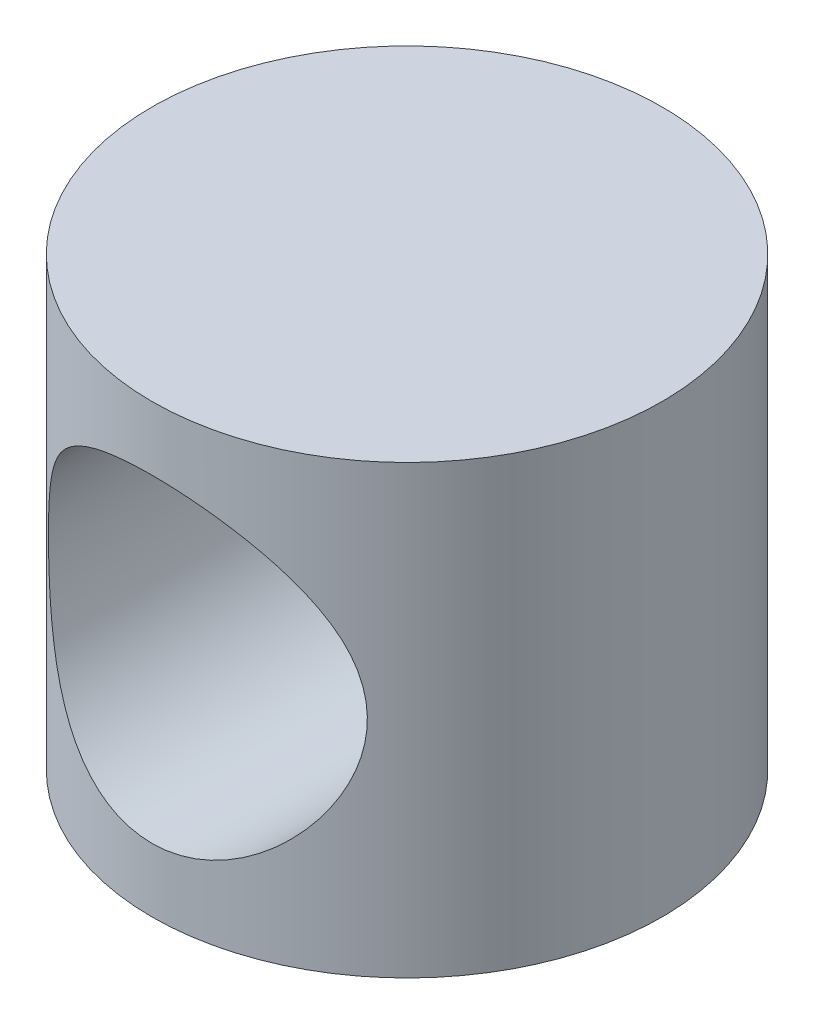
ISO-10303-21;
HEADER;
FILE_DESCRIPTION(('STEP AP214'),'2;1');
FILE_NAME('part.step','',(''),(''),'','','');
FILE_SCHEMA(('AUTOMOTIVE_DESIGN { 1 0 10303 214 1 1 1 1 }'));
ENDSEC;
DATA;
#1=APPLICATION_CONTEXT('core data for automotive mechanical design processes');
#2=APPLICATION_PROTOCOL_DEFINITION('international standard','automotive_design',2000,#1);
#3=PRODUCT_CONTEXT('',#1,'mechanical');
#4=PRODUCT('Part','Part','',(#3));
#5=PRODUCT_RELATED_PRODUCT_CATEGORY('part','',(#4));
#6=PRODUCT_DEFINITION_FORMATION('','',#4);
#7=PRODUCT_DEFINITION_CONTEXT('part definition',#1,'design');
#8=PRODUCT_DEFINITION('design','',#6,#7);
#9=PRODUCT_DEFINITION_SHAPE('','',#8);
#10=(LENGTH_UNIT() NAMED_UNIT(*) SI_UNIT(.MILLI.,.METRE.));
#11=(NAMED_UNIT(*) PLANE_ANGLE_UNIT() SI_UNIT($,.RADIAN.));
#12=(NAMED_UNIT(*) SI_UNIT($,.STERADIAN.) SOLID_ANGLE_UNIT());
#13=UNCERTAINTY_MEASURE_WITH_UNIT(LENGTH_MEASURE(1.E-05),#10,'distance_accuracy_value','');
#14=(GEOMETRIC_REPRESENTATION_CONTEXT(3) GLOBAL_UNCERTAINTY_ASSIGNED_CONTEXT((#13)) GLOBAL_UNIT_ASSIGNED_CONTEXT((#10,
#11,#12)) REPRESENTATION_CONTEXT('',''));
#15=CARTESIAN_POINT('',(0.,0.,0.));
#16=DIRECTION('',(0.,0.,1.));
#17=DIRECTION('',(1.,0.,0.));
#18=AXIS2_PLACEMENT_3D('',#15,#16,#17);
#19=CARTESIAN_POINT('',(0.,7.,0.));
#20=DIRECTION('',(0.,-1.,0.));
#21=DIRECTION('',(0.,0.,-1.));
#22=AXIS2_PLACEMENT_3D('',#19,#20,#21);
#23=CYLINDRICAL_SURFACE('',#22,4.);
#24=CARTESIAN_POINT('',(0.,7.,0.));
#25=DIRECTION('',(0.,1.,0.));
#26=DIRECTION('',(0.,0.,1.));
#27=AXIS2_PLACEMENT_3D('',#24,#25,#26);
#28=CIRCLE('',#27,4.);
#29=CARTESIAN_POINT('',(0.,7.,4.));
#30=VERTEX_POINT('',#29);
#31=EDGE_CURVE('E10',#30,#30,#28,.T.);
#32=ORIENTED_EDGE('',*,*,#31,.F.);
#33=EDGE_LOOP('',(#32));
#34=FACE_BOUND('',#33,.T.);
#35=CARTESIAN_POINT('',(0.,0.,0.));
#36=DIRECTION('',(0.,1.,0.));
#37=DIRECTION('',(0.,0.,1.));
#38=AXIS2_PLACEMENT_3D('',#35,#36,#37);
#39=CIRCLE('',#38,4.);
#40=CARTESIAN_POINT('',(0.,0.,4.));
#41=VERTEX_POINT('',#40);
#42=EDGE_CURVE('E56',#41,#41,#39,.T.);
#43=ORIENTED_EDGE('',*,*,#42,.T.);
#44=EDGE_LOOP('',(#43));
#45=FACE_BOUND('',#44,.T.);
#46=CARTESIAN_POINT('',(-2.5,3.5,3.1224989991992));
#47=CARTESIAN_POINT('',(-2.49999941097139,3.43784324855449,3.12249991555421));
#48=CARTESIAN_POINT('',(-2.49767581942173,3.37567405332921,3.12436490733917));
#49=CARTESIAN_POINT('',(-2.48843349840857,3.25188282045226,3.13172923119026));
#50=CARTESIAN_POINT('',(-2.48151206248433,3.1902611267429,3.13723070381364));
#51=CARTESIAN_POINT('',(-2.45397595058365,3.00677395225629,3.15888953558505));
#52=CARTESIAN_POINT('',(-2.42658990946459,2.88645166881102,3.18020036271142));
#53=CARTESIAN_POINT('',(-2.35576217141198,2.65440180212176,3.23299770760367));
#54=CARTESIAN_POINT('',(-2.31245961359202,2.5426095849449,3.26439575383209));
#55=CARTESIAN_POINT('',(-2.21143916430899,2.32799147466594,3.3336600088444));
#56=CARTESIAN_POINT('',(-2.15372087963017,2.22516582624691,3.37152639405534));
#57=CARTESIAN_POINT('',(-2.01647682425577,2.01626601869634,3.45559225121876));
#58=CARTESIAN_POINT('',(-1.93506425666949,1.91160667499548,3.50222814511578));
#59=CARTESIAN_POINT('',(-1.75662526657432,1.7162384483762,3.59505503533368));
#60=CARTESIAN_POINT('',(-1.65958538899782,1.62554172004638,3.64124561158438));
#61=CARTESIAN_POINT('',(-1.43833990582854,1.44977970182732,3.73459524771314));
#62=CARTESIAN_POINT('',(-1.31226934259652,1.36671381554957,3.78119887781505));
#63=CARTESIAN_POINT('',(-1.11163395543429,1.25945484526376,3.84307251838774));
#64=CARTESIAN_POINT('',(-1.04281240974104,1.22658486166689,3.86236283092052));
#65=CARTESIAN_POINT('',(-0.901758767615549,1.16704531463672,3.89770436975436));
#66=CARTESIAN_POINT('',(-0.829529068393796,1.14037146896158,3.91375783207118));
#67=CARTESIAN_POINT('',(-0.689700297916576,1.09601618474372,3.94066759113823));
#68=CARTESIAN_POINT('',(-0.622371981278588,1.07769802348189,3.95188535984466));
#69=CARTESIAN_POINT('',(-0.485997575898808,1.04669771368664,3.97096241909162));
#70=CARTESIAN_POINT('',(-0.416952503441682,1.03401231078379,3.97882364879721));
#71=CARTESIAN_POINT('',(-0.277765449857174,1.01448620236546,3.99095470334737));
#72=CARTESIAN_POINT('',(-0.207624174243906,1.00764188348659,3.99522674847834));
#73=CARTESIAN_POINT('',(-0.066911446659939,0.999900786610777,4.00006125072438));
#74=CARTESIAN_POINT('',(0.00365995486027895,0.99900332403665,4.00062413482248));
#75=CARTESIAN_POINT('',(0.196045081555538,1.00472537354725,3.99704479619503));
#76=CARTESIAN_POINT('',(0.317681845488536,1.01730650307888,3.98917040897436));
#77=CARTESIAN_POINT('',(0.556636494620256,1.05973021796612,3.96290903275931));
#78=CARTESIAN_POINT('',(0.673954052677426,1.08957410797362,3.94452124920477));
#79=CARTESIAN_POINT('',(0.901771991763867,1.16520855928326,3.89876170711609));
#80=CARTESIAN_POINT('',(1.01225407159606,1.21103991957107,3.87136697381047));
#81=CARTESIAN_POINT('',(1.22404012071223,1.31693723898429,3.80971291751354));
#82=CARTESIAN_POINT('',(1.32534199174245,1.37700644106365,3.77545203089318));
#83=CARTESIAN_POINT('',(1.52942649744659,1.51805641692367,3.69786441247167));
#84=CARTESIAN_POINT('',(1.63082454612907,1.60070927669048,3.65394006381521));
#85=CARTESIAN_POINT('',(1.81919733573063,1.78026473720707,3.56390927740507));
#86=CARTESIAN_POINT('',(1.90615071842624,1.87718804638397,3.51779973570409));
#87=CARTESIAN_POINT('',(2.07470887167909,2.09741125317348,3.42142883464466));
#88=CARTESIAN_POINT('',(2.15413229677844,2.22250276335808,3.37141162686597));
#89=CARTESIAN_POINT('',(2.29052307550563,2.48729223730141,3.28028278192382));
#90=CARTESIAN_POINT('',(2.34753179448504,2.62696268745311,3.23915480386931));
#91=CARTESIAN_POINT('',(2.42437133527931,2.87953880610625,3.18183753131763));
#92=CARTESIAN_POINT('',(2.45003683445404,2.98982192521349,3.16193408602513));
#93=CARTESIAN_POINT('',(2.48620337073091,3.21423037755989,3.13358277759547));
#94=CARTESIAN_POINT('',(2.49672512520811,3.32835024265681,3.12511926504439));
#95=CARTESIAN_POINT('',(2.5019707209518,3.55745736050245,3.12092267030677));
#96=CARTESIAN_POINT('',(2.49665835896695,3.67244600047845,3.12521876170185));
#97=CARTESIAN_POINT('',(2.47051466367814,3.89956116431848,3.14592085836188));
#98=CARTESIAN_POINT('',(2.44967047849126,4.01168523837118,3.16233689222906));
#99=CARTESIAN_POINT('',(2.39409874195038,4.22843675942569,3.20460120797143));
#100=CARTESIAN_POINT('',(2.35960571424758,4.33315731589432,3.23028954367817));
#101=CARTESIAN_POINT('',(2.27804893702243,4.53557469989379,3.28831148388749));
#102=CARTESIAN_POINT('',(2.23098072583746,4.63326901887797,3.32064744602081));
#103=CARTESIAN_POINT('',(2.11530798730694,4.83861194166319,3.39574401285203));
#104=CARTESIAN_POINT('',(2.04430931160544,4.94461452730177,3.43931724293015));
#105=CARTESIAN_POINT('',(1.88737868921489,5.14437066065426,3.52787943213338));
#106=CARTESIAN_POINT('',(1.80143124902619,5.23811132124234,3.57286982004467));
#107=CARTESIAN_POINT('',(1.6007693249212,5.42596407064096,3.66766209459505));
#108=CARTESIAN_POINT('',(1.48365201617177,5.5177273984849,3.71707933883201));
#109=CARTESIAN_POINT('',(1.23256787407809,5.68014701471972,3.80768973398606));
#110=CARTESIAN_POINT('',(1.09860897940974,5.75081319512692,3.84888673619009));
#111=CARTESIAN_POINT('',(0.89193080465508,5.83658106797498,3.89988966499776));
#112=CARTESIAN_POINT('',(0.824318196039419,5.86129744395128,3.91477055097245));
#113=CARTESIAN_POINT('',(0.686640792876421,5.90493827673227,3.94124643918619));
#114=CARTESIAN_POINT('',(0.616577444051133,5.92386608615092,3.95284334314805));
#115=CARTESIAN_POINT('',(0.474639231464261,5.95560583013926,3.9723851203995));
#116=CARTESIAN_POINT('',(0.402766005755504,5.96842309951643,3.98033317908836));
#117=CARTESIAN_POINT('',(0.257881807142458,5.98773917229289,3.99234168343343));
#118=CARTESIAN_POINT('',(0.184871024482532,5.99423902093079,3.99640277220024));
#119=CARTESIAN_POINT('',(-0.013110277424895,6.00307151550711,4.00191521492706));
#120=CARTESIAN_POINT('',(-0.138539079205452,5.99926579290941,3.99952706123947));
#121=CARTESIAN_POINT('',(-0.386583137102134,5.97308241045447,3.98321975018363));
#122=CARTESIAN_POINT('',(-0.509198520626833,5.95070559332119,3.96930111604857));
#123=CARTESIAN_POINT('',(-0.744080605483852,5.88967758445389,3.93192083384285));
#124=CARTESIAN_POINT('',(-0.856558752631814,5.85161792643533,3.90880701054803));
#125=CARTESIAN_POINT('',(-1.07343034721918,5.76088053755652,3.85489971248843));
#126=CARTESIAN_POINT('',(-1.17782242685803,5.7082003404328,3.82410494215309));
#127=CARTESIAN_POINT('',(-1.38731297754797,5.58367872128004,3.75350673935648));
#128=CARTESIAN_POINT('',(-1.4913601218378,5.5104160092425,3.71310001864657));
#129=CARTESIAN_POINT('',(-1.68643334934803,5.3498467674859,3.62867283985206));
#130=CARTESIAN_POINT('',(-1.77744451843681,5.26252439116572,3.58464833191203));
#131=CARTESIAN_POINT('',(-1.95744716561589,5.06176748493813,3.49000828219718));
#132=CARTESIAN_POINT('',(-2.04425661250063,4.94638338742857,3.43935738427104));
#133=CARTESIAN_POINT('',(-2.19754648509904,4.70071059024024,3.34349647457112));
#134=CARTESIAN_POINT('',(-2.26403815415028,4.57043018884747,3.2982834620419));
#135=CARTESIAN_POINT('',(-2.3619822941284,4.32719469921509,3.22859539780091));
#136=CARTESIAN_POINT('',(-2.39792458576829,4.21672942784644,3.20174639338769));
#137=CARTESIAN_POINT('',(-2.45425618419746,3.99006065699822,3.1587835810451));
#138=CARTESIAN_POINT('',(-2.47469472410168,3.87387658020028,3.14263581150428));
#139=CARTESIAN_POINT('',(-2.49119847139522,3.71394000535393,3.12952857640607));
#140=CARTESIAN_POINT('',(-2.49449433837959,3.67127447429134,3.1268999430677));
#141=CARTESIAN_POINT('',(-2.49889558125807,3.58574130104825,3.12338461939862));
#142=CARTESIAN_POINT('',(-2.50000040629188,3.54287361075665,3.12249836712871));
#143=CARTESIAN_POINT('',(-2.5,3.5,3.1224989991992));
#144=B_SPLINE_CURVE_WITH_KNOTS('',3,(#46,#47,#48,#49,#50,#51,#52,#53,#54,#55,#56,#57,#58,#59,
#60,#61,#62,#63,#64,#65,#66,#67,#68,#69,#70,#71,#72,#73,#74,#75,#76,#77,#78,#79,#80,#81,#82,#83,
#84,#85,#86,#87,#88,#89,#90,#91,#92,#93,#94,#95,#96,#97,#98,#99,#100,#101,#102,#103,#104,#105,
#106,#107,#108,#109,#110,#111,#112,#113,#114,#115,#116,#117,#118,#119,#120,#121,#122,#123,#124,
#125,#126,#127,#128,#129,#130,#131,#132,#133,#134,#135,#136,#137,#138,#139,#140,#141,#142,#143),
.UNSPECIFIED.,.T.,.F.,(4,2,2,2,2,2,2,2,2,2,2,2,2,2,2,2,2,2,2,2,2,2,2,2,2,2,2,2,2,2,2,2,2,2,2,2,
2,2,2,2,2,2,2,2,2,2,2,2,4),(0.,0.18641531585846,0.372940459994496,0.746478880764687,
1.11682668423133,1.48718459072605,1.90722798685071,2.32763499192879,2.7987602926597,
3.03445880867314,3.26999394209509,3.48170145743205,3.69328649746504,3.90474055342595,
4.11617026725867,4.48184709708114,4.84755156693919,5.21419620193004,5.58092442797435,
5.99329080205307,6.40626158573465,6.87316206383505,7.33919680735486,7.68265621505466,
8.02564530559509,8.36941921026407,8.7134778886509,9.05186495232125,9.390372235192,
9.79332737765187,10.1967026751544,10.6647326786671,11.1325428866818,11.3527929661039,
11.5729152387446,11.7928449800804,12.0127383271002,12.3871595324234,12.7615637480926,
13.1229788842094,13.4844550226785,13.8834503840958,14.2828986410983,14.7399238503459,
15.1966956936287,15.5530255473292,15.9082190611886,16.0367696833384,16.1653526209168),.UNSPECIFIED.);
#145=CARTESIAN_POINT('',(-2.5,3.5,3.1224989991992));
#146=VERTEX_POINT('',#145);
#147=EDGE_CURVE('E63',#146,#146,#144,.T.);
#148=ORIENTED_EDGE('',*,*,#147,.F.);
#149=EDGE_LOOP('',(#148));
#150=FACE_BOUND('',#149,.T.);
#151=CARTESIAN_POINT('',(0.,6.,-4.));
#152=CARTESIAN_POINT('',(0.127017476559871,5.99998952385639,-3.99999041333571));
#153=CARTESIAN_POINT('',(0.254191951791703,5.99025350009832,-3.9938860659399));
#154=CARTESIAN_POINT('',(0.504637456621344,5.95182887031573,-3.97004375552586));
#155=CARTESIAN_POINT('',(0.627900575825985,5.92310413973879,-3.95228361873137));
#156=CARTESIAN_POINT('',(0.866410868269162,5.84837714671246,-3.90691695293563));
#157=CARTESIAN_POINT('',(0.98169442070943,5.80246039021243,-3.87935918690877));
#158=CARTESIAN_POINT('',(1.20252080434994,5.69522833250853,-3.81669199838277));
#159=CARTESIAN_POINT('',(1.30806471304098,5.63391473744688,-3.7815834126609));
#160=CARTESIAN_POINT('',(1.51594836437078,5.4922268434089,-3.70340304945467));
#161=CARTESIAN_POINT('',(1.61735911616791,5.41072139729824,-3.65991924217889));
#162=CARTESIAN_POINT('',(1.80597275567284,5.23356165374148,-3.57062700058922));
#163=CARTESIAN_POINT('',(1.89315621594405,5.13788834426107,-3.52481549782957));
#164=CARTESIAN_POINT('',(2.06285746302521,4.9199322107088,-3.42860837235627));
#165=CARTESIAN_POINT('',(2.14314412018317,4.79580042656906,-3.37843221966147));
#166=CARTESIAN_POINT('',(2.28147932079995,4.53287036932165,-3.28660396278105));
#167=CARTESIAN_POINT('',(2.33956541787438,4.39409737483202,-3.2449375200046));
#168=CARTESIAN_POINT('',(2.41866801180576,4.14237895245428,-3.18619151248815));
#169=CARTESIAN_POINT('',(2.44539104794679,4.03206636308168,-3.16553811970886));
#170=CARTESIAN_POINT('',(2.4836368711914,3.80738814861931,-3.1356271466086));
#171=CARTESIAN_POINT('',(2.49518112485638,3.69302848282679,-3.12635347378456));
#172=CARTESIAN_POINT('',(2.50237836690497,3.46317396712363,-3.12059771534501));
#173=CARTESIAN_POINT('',(2.49798968200884,3.34767692942204,-3.12414917427958));
#174=CARTESIAN_POINT('',(2.47352633347829,3.11937979127337,-3.14354804883411));
#175=CARTESIAN_POINT('',(2.45343909745149,3.00658192715007,-3.15940531965489));
#176=CARTESIAN_POINT('',(2.3993620946426,2.78912310325641,-3.20065145822146));
#177=CARTESIAN_POINT('',(2.36570043522604,2.68433512028263,-3.22581428653572));
#178=CARTESIAN_POINT('',(2.28580369589507,2.48167760352679,-3.28291134443418));
#179=CARTESIAN_POINT('',(2.2395641689404,2.38381053215654,-3.31484796808523));
#180=CARTESIAN_POINT('',(2.12589830407261,2.17833359248984,-3.38909625095658));
#181=CARTESIAN_POINT('',(2.05612773657747,2.07231894814762,-3.4322315520855));
#182=CARTESIAN_POINT('',(1.90176111958637,1.8723388730236,-3.52011451554715));
#183=CARTESIAN_POINT('',(1.81714983251341,1.77838599995486,-3.56486379714022));
#184=CARTESIAN_POINT('',(1.61904732877734,1.58939899041739,-3.65959667460597));
#185=CARTESIAN_POINT('',(1.50309447420016,1.4967440572784,-3.70922571443728));
#186=CARTESIAN_POINT('',(1.25426444468514,1.33228820636898,-3.8005660184067));
#187=CARTESIAN_POINT('',(1.12139395127005,1.26047909219051,-3.84228039228673));
#188=CARTESIAN_POINT('',(0.915775751567441,1.17265404336502,-3.89435975869902));
#189=CARTESIAN_POINT('',(0.848193583187391,1.14716571356961,-3.90966874385268));
#190=CARTESIAN_POINT('',(0.710492049478444,1.10199234952136,-3.93701839875445));
#191=CARTESIAN_POINT('',(0.640374175967898,1.08230396342918,-3.94906095588034));
#192=CARTESIAN_POINT('',(0.498239019538471,1.04906583835761,-3.96949699527849));
#193=CARTESIAN_POINT('',(0.426223500915274,1.035510596474,-3.97789374843884));
#194=CARTESIAN_POINT('',(0.280965673560731,1.01475370668643,-3.99078766491331));
#195=CARTESIAN_POINT('',(0.207723576570751,1.00755097345269,-3.99528549435853));
#196=CARTESIAN_POINT('',(0.00911917689680526,0.996890695356459,-4.00193773474167));
#197=CARTESIAN_POINT('',(-0.116782016705695,0.999599636876483,-4.000238122366));
#198=CARTESIAN_POINT('',(-0.365967766011667,1.02375966446545,-3.98518313408306));
#199=CARTESIAN_POINT('',(-0.48925249935995,1.04520947392473,-3.97182855210102));
#200=CARTESIAN_POINT('',(-0.7250361940026,1.10447858798278,-3.93547975555369));
#201=CARTESIAN_POINT('',(-0.837768421062911,1.14162472076979,-3.91288306371126));
#202=CARTESIAN_POINT('',(-1.05527816125332,1.23059237131243,-3.85991402897874));
#203=CARTESIAN_POINT('',(-1.16005433861599,1.28241634650143,-3.82954038411642));
#204=CARTESIAN_POINT('',(-1.37016761969194,1.40503053750783,-3.75980014020658));
#205=CARTESIAN_POINT('',(-1.47449380296905,1.47720717227503,-3.71983526755373));
#206=CARTESIAN_POINT('',(-1.67028541330073,1.63558769646929,-3.63613942885727));
#207=CARTESIAN_POINT('',(-1.76173634038025,1.72180716888569,-3.59240430473134));
#208=CARTESIAN_POINT('',(-1.94294835276253,1.92027008984565,-3.49811738486729));
#209=CARTESIAN_POINT('',(-2.03053702733638,2.03447441549752,-3.44749766579192));
#210=CARTESIAN_POINT('',(-2.18560704916439,2.27775156698257,-3.35133525746893));
#211=CARTESIAN_POINT('',(-2.25310231693768,2.40681401289131,-3.30578906708369));
#212=CARTESIAN_POINT('',(-2.35369543821018,2.64938429659957,-3.23467060578839));
#213=CARTESIAN_POINT('',(-2.39103791720685,2.76048150138871,-3.20691272363805));
#214=CARTESIAN_POINT('',(-2.45000216420748,2.98878629161345,-3.16210061351252));
#215=CARTESIAN_POINT('',(-2.47164849805251,3.10598401968943,-3.1450296652982));
#216=CARTESIAN_POINT('',(-2.49802767469226,3.3441805529704,-3.124126499326));
#217=CARTESIAN_POINT('',(-2.50266374586469,3.46519716787993,-3.12037003193165));
#218=CARTESIAN_POINT('',(-2.49439556773531,3.70626192382952,-3.12698126375719));
#219=CARTESIAN_POINT('',(-2.48148548821457,3.82630972961936,-3.13735365770479));
#220=CARTESIAN_POINT('',(-2.44076547086104,4.05205957943611,-3.16910777009989));
#221=CARTESIAN_POINT('',(-2.41423847191721,4.15813856450238,-3.18953614189074));
#222=CARTESIAN_POINT('',(-2.34835238743426,4.36427015751826,-3.23835062785226));
#223=CARTESIAN_POINT('',(-2.30898795090781,4.46432023181727,-3.26674005971309));
#224=CARTESIAN_POINT('',(-2.21205415803959,4.67119332433814,-3.33327797617852));
#225=CARTESIAN_POINT('',(-2.15267427981667,4.77689994626374,-3.3722442852408));
#226=CARTESIAN_POINT('',(-2.01999894889208,4.97787738570926,-3.45335445323995));
#227=CARTESIAN_POINT('',(-1.94669224594686,5.07313966737408,-3.49550086438999));
#228=CARTESIAN_POINT('',(-1.77134669685941,5.27002558379843,-3.58803675426846));
#229=CARTESIAN_POINT('',(-1.66649284489893,5.36916976153929,-3.63840488260278));
#230=CARTESIAN_POINT('',(-1.43961937990848,5.54900159612506,-3.7339805383823));
#231=CARTESIAN_POINT('',(-1.3175892119665,5.62967782367752,-3.77918486147258));
#232=CARTESIAN_POINT('',(-1.12346357942551,5.73456343855876,-3.83959214728415));
#233=CARTESIAN_POINT('',(-1.05679601158094,5.76687480004699,-3.85851834157058));
#234=CARTESIAN_POINT('',(-0.920199584374062,5.82567225182379,-3.89335165397882));
#235=CARTESIAN_POINT('',(-0.850272633931984,5.8521617011351,-3.9092605122592));
#236=CARTESIAN_POINT('',(-0.707873688437766,5.89885714446217,-3.93753374175517));
#237=CARTESIAN_POINT('',(-0.635409144572264,5.91908005724566,-3.94990764965183));
#238=CARTESIAN_POINT('',(-0.488456989557114,5.95297545558237,-3.97075677458059));
#239=CARTESIAN_POINT('',(-0.413970913545527,5.96665277243948,-3.97923486692924));
#240=CARTESIAN_POINT('',(-0.282852605094049,5.98459041022673,-3.99038271291772));
#241=CARTESIAN_POINT('',(-0.226501515914867,5.99036153025218,-3.99398159517595));
#242=CARTESIAN_POINT('',(-0.113444074519046,5.99806878362715,-3.99879245372932));
#243=CARTESIAN_POINT('',(-0.056737700531305,6.00000467961036,-4.00000428228699));
#244=CARTESIAN_POINT('',(0.,6.,-4.));
#245=B_SPLINE_CURVE_WITH_KNOTS('',3,(#151,#152,#153,#154,#155,#156,#157,#158,#159,#160,#161,
#162,#163,#164,#165,#166,#167,#168,#169,#170,#171,#172,#173,#174,#175,#176,#177,#178,#179,#180,
#181,#182,#183,#184,#185,#186,#187,#188,#189,#190,#191,#192,#193,#194,#195,#196,#197,#198,#199,
#200,#201,#202,#203,#204,#205,#206,#207,#208,#209,#210,#211,#212,#213,#214,#215,#216,#217,#218,
#219,#220,#221,#222,#223,#224,#225,#226,#227,#228,#229,#230,#231,#232,#233,#234,#235,#236,#237,
#238,#239,#240,#241,#242,#243,#244),.UNSPECIFIED.,.T.,.F.,(4,2,2,2,2,2,2,2,2,2,2,2,2,2,2,2,2,2,
2,2,2,2,2,2,2,2,2,2,2,2,2,2,2,2,2,2,2,2,2,2,2,2,2,2,2,2,4),(0.,0.380824602868265,
0.762375788256924,1.14205397519027,1.52169010807759,1.93164374107244,2.34215256651403,
2.80825951705947,3.27357449214021,3.61824017759434,3.96241789414782,4.30749646997556,
4.65285169010166,4.99031678920873,5.32790135816066,5.72854900708719,6.12961045150364,
6.59684361399044,7.06389281455723,7.28510978359956,7.50619865744383,7.72708876613708,
7.94794112831293,8.32363778110178,8.69930884379593,9.06028425977629,9.42132014771965,
9.81879878896137,10.216721545704,10.6724083464246,11.1277787130885,11.4876929754247,
11.8470427174174,12.2084336629143,12.5699447204276,12.9023575499051,13.2349091154192,
13.6156046298899,13.9966089922257,14.4531049498526,14.9098826607203,15.1389848639481,
15.3679545348469,15.5963005225023,15.8244777070605,15.994578512822,16.1646898459841),.UNSPECIFIED.);
#246=CARTESIAN_POINT('',(0.,6.,-4.));
#247=VERTEX_POINT('',#246);
#248=EDGE_CURVE('E47',#247,#247,#245,.T.);
#249=ORIENTED_EDGE('',*,*,#248,.F.);
#250=EDGE_LOOP('',(#249));
#251=FACE_BOUND('',#250,.T.);
#252=ADVANCED_FACE('F43',(#34,#45,#150,#251),#23,.T.);
#253=CARTESIAN_POINT('',(0.,7.,0.));
#254=DIRECTION('',(0.,1.,0.));
#255=DIRECTION('',(0.,0.,1.));
#256=AXIS2_PLACEMENT_3D('',#253,#254,#255);
#257=PLANE('',#256);
#258=ORIENTED_EDGE('',*,*,#31,.T.);
#259=EDGE_LOOP('',(#258));
#260=FACE_BOUND('',#259,.T.);
#261=ADVANCED_FACE('F75',(#260),#257,.T.);
#262=CARTESIAN_POINT('',(0.,0.,0.));
#263=DIRECTION('',(0.,1.,0.));
#264=DIRECTION('',(0.,0.,1.));
#265=AXIS2_PLACEMENT_3D('',#262,#263,#264);
#266=PLANE('',#265);
#267=ORIENTED_EDGE('',*,*,#42,.F.);
#268=EDGE_LOOP('',(#267));
#269=FACE_BOUND('',#268,.T.);
#270=ADVANCED_FACE('F73',(#269),#266,.F.);
#271=CARTESIAN_POINT('',(0.,3.5,7.));
#272=DIRECTION('',(0.,0.,-1.));
#273=DIRECTION('',(-1.,0.,0.));
#274=AXIS2_PLACEMENT_3D('',#271,#272,#273);
#275=CYLINDRICAL_SURFACE('',#274,2.5);
#276=ORIENTED_EDGE('',*,*,#147,.T.);
#277=EDGE_LOOP('',(#276));
#278=FACE_BOUND('',#277,.T.);
#279=ORIENTED_EDGE('',*,*,#248,.T.);
#280=EDGE_LOOP('',(#279));
#281=FACE_BOUND('',#280,.T.);
#282=ADVANCED_FACE('F69',(#278,#281),#275,.F.);
#283=CLOSED_SHELL('',(#252,#261,#270,#282));
#284=MANIFOLD_SOLID_BREP('B2',#283);
#285=ADVANCED_BREP_SHAPE_REPRESENTATION('',(#18,#284),#14);
#286=SHAPE_DEFINITION_REPRESENTATION(#9,#285);
ENDSEC;
END-ISO-10303-21;
